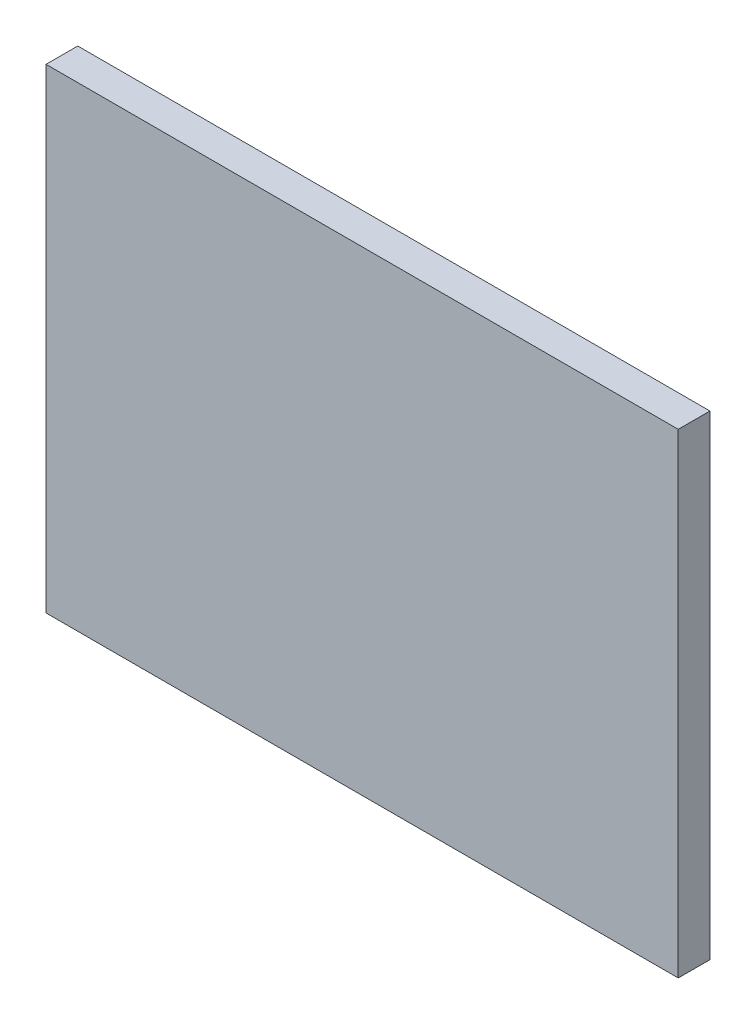
ISO-10303-21;
HEADER;
FILE_DESCRIPTION(('STEP AP214'),'2;1');
FILE_NAME('part.step','',(''),(''),'','','');
FILE_SCHEMA(('AUTOMOTIVE_DESIGN { 1 0 10303 214 1 1 1 1 }'));
ENDSEC;
DATA;
#1=APPLICATION_CONTEXT('core data for automotive mechanical design processes');
#2=APPLICATION_PROTOCOL_DEFINITION('international standard','automotive_design',2000,#1);
#3=PRODUCT_CONTEXT('',#1,'mechanical');
#4=PRODUCT('Part','Part','',(#3));
#5=PRODUCT_RELATED_PRODUCT_CATEGORY('part','',(#4));
#6=PRODUCT_DEFINITION_FORMATION('','',#4);
#7=PRODUCT_DEFINITION_CONTEXT('part definition',#1,'design');
#8=PRODUCT_DEFINITION('design','',#6,#7);
#9=PRODUCT_DEFINITION_SHAPE('','',#8);
#10=(LENGTH_UNIT() NAMED_UNIT(*) SI_UNIT(.MILLI.,.METRE.));
#11=(NAMED_UNIT(*) PLANE_ANGLE_UNIT() SI_UNIT($,.RADIAN.));
#12=(NAMED_UNIT(*) SI_UNIT($,.STERADIAN.) SOLID_ANGLE_UNIT());
#13=UNCERTAINTY_MEASURE_WITH_UNIT(LENGTH_MEASURE(1.E-05),#10,'distance_accuracy_value','');
#14=(GEOMETRIC_REPRESENTATION_CONTEXT(3) GLOBAL_UNCERTAINTY_ASSIGNED_CONTEXT((#13)) GLOBAL_UNIT_ASSIGNED_CONTEXT((#10,
#11,#12)) REPRESENTATION_CONTEXT('',''));
#15=CARTESIAN_POINT('',(0.,0.,0.));
#16=DIRECTION('',(0.,0.,1.));
#17=DIRECTION('',(1.,0.,0.));
#18=AXIS2_PLACEMENT_3D('',#15,#16,#17);
#19=CARTESIAN_POINT('',(0.,0.,5.9));
#20=DIRECTION('',(1.,0.,0.));
#21=DIRECTION('',(0.,0.,-1.));
#22=AXIS2_PLACEMENT_3D('',#19,#20,#21);
#23=PLANE('',#22);
#24=DIRECTION('',(0.,-1.,0.));
#25=VECTOR('',#24,1.);
#26=CARTESIAN_POINT('',(0.,0.,0.));
#27=LINE('',#26,#25);
#28=CARTESIAN_POINT('',(0.,88.43,0.));
#29=VERTEX_POINT('',#28);
#30=CARTESIAN_POINT('',(0.,0.,0.));
#31=VERTEX_POINT('',#30);
#32=EDGE_CURVE('E96',#29,#31,#27,.T.);
#33=ORIENTED_EDGE('',*,*,#32,.T.);
#34=DIRECTION('',(0.,0.,-1.));
#35=VECTOR('',#34,1.);
#36=CARTESIAN_POINT('',(0.,0.,5.9));
#37=LINE('',#36,#35);
#38=CARTESIAN_POINT('',(0.,0.,5.9));
#39=VERTEX_POINT('',#38);
#40=EDGE_CURVE('E11',#39,#31,#37,.T.);
#41=ORIENTED_EDGE('',*,*,#40,.F.);
#42=DIRECTION('',(0.,-1.,0.));
#43=VECTOR('',#42,1.);
#44=CARTESIAN_POINT('',(0.,0.,5.9));
#45=LINE('',#44,#43);
#46=CARTESIAN_POINT('',(0.,88.43,5.9));
#47=VERTEX_POINT('',#46);
#48=EDGE_CURVE('E84',#47,#39,#45,.T.);
#49=ORIENTED_EDGE('',*,*,#48,.F.);
#50=DIRECTION('',(0.,0.,-1.));
#51=VECTOR('',#50,1.);
#52=CARTESIAN_POINT('',(0.,88.43,5.9));
#53=LINE('',#52,#51);
#54=EDGE_CURVE('E92',#47,#29,#53,.T.);
#55=ORIENTED_EDGE('',*,*,#54,.T.);
#56=EDGE_LOOP('',(#33,#41,#49,#55));
#57=FACE_BOUND('',#56,.T.);
#58=ADVANCED_FACE('F33',(#57),#23,.F.);
#59=CARTESIAN_POINT('',(0.,0.,5.9));
#60=DIRECTION('',(0.,1.,0.));
#61=DIRECTION('',(0.,0.,1.));
#62=AXIS2_PLACEMENT_3D('',#59,#60,#61);
#63=PLANE('',#62);
#64=DIRECTION('',(1.,0.,0.));
#65=VECTOR('',#64,1.);
#66=CARTESIAN_POINT('',(0.,0.,0.));
#67=LINE('',#66,#65);
#68=CARTESIAN_POINT('',(117.65,0.,0.));
#69=VERTEX_POINT('',#68);
#70=EDGE_CURVE('E88',#31,#69,#67,.T.);
#71=ORIENTED_EDGE('',*,*,#70,.T.);
#72=DIRECTION('',(0.,0.,-1.));
#73=VECTOR('',#72,1.);
#74=CARTESIAN_POINT('',(117.65,0.,5.9));
#75=LINE('',#74,#73);
#76=CARTESIAN_POINT('',(117.65,0.,5.9));
#77=VERTEX_POINT('',#76);
#78=EDGE_CURVE('E41',#77,#69,#75,.T.);
#79=ORIENTED_EDGE('',*,*,#78,.F.);
#80=DIRECTION('',(1.,0.,0.));
#81=VECTOR('',#80,1.);
#82=CARTESIAN_POINT('',(0.,0.,5.9));
#83=LINE('',#82,#81);
#84=EDGE_CURVE('E79',#39,#77,#83,.T.);
#85=ORIENTED_EDGE('',*,*,#84,.F.);
#86=ORIENTED_EDGE('',*,*,#40,.T.);
#87=EDGE_LOOP('',(#71,#79,#85,#86));
#88=FACE_BOUND('',#87,.T.);
#89=ADVANCED_FACE('F87',(#88),#63,.F.);
#90=CARTESIAN_POINT('',(117.65,0.,5.9));
#91=DIRECTION('',(-1.,0.,0.));
#92=DIRECTION('',(0.,-1.,0.));
#93=AXIS2_PLACEMENT_3D('',#90,#91,#92);
#94=PLANE('',#93);
#95=DIRECTION('',(0.,1.,0.));
#96=VECTOR('',#95,1.);
#97=CARTESIAN_POINT('',(117.65,0.,0.));
#98=LINE('',#97,#96);
#99=CARTESIAN_POINT('',(117.65,88.43,0.));
#100=VERTEX_POINT('',#99);
#101=EDGE_CURVE('E66',#69,#100,#98,.T.);
#102=ORIENTED_EDGE('',*,*,#101,.T.);
#103=DIRECTION('',(0.,0.,-1.));
#104=VECTOR('',#103,1.);
#105=CARTESIAN_POINT('',(117.65,88.43,5.9));
#106=LINE('',#105,#104);
#107=CARTESIAN_POINT('',(117.65,88.43,5.9));
#108=VERTEX_POINT('',#107);
#109=EDGE_CURVE('E89',#108,#100,#106,.T.);
#110=ORIENTED_EDGE('',*,*,#109,.F.);
#111=DIRECTION('',(0.,1.,0.));
#112=VECTOR('',#111,1.);
#113=CARTESIAN_POINT('',(117.65,0.,5.9));
#114=LINE('',#113,#112);
#115=EDGE_CURVE('E82',#77,#108,#114,.T.);
#116=ORIENTED_EDGE('',*,*,#115,.F.);
#117=ORIENTED_EDGE('',*,*,#78,.T.);
#118=EDGE_LOOP('',(#102,#110,#116,#117));
#119=FACE_BOUND('',#118,.T.);
#120=ADVANCED_FACE('F90',(#119),#94,.F.);
#121=CARTESIAN_POINT('',(0.,88.43,5.9));
#122=DIRECTION('',(0.,-1.,0.));
#123=DIRECTION('',(0.,0.,-1.));
#124=AXIS2_PLACEMENT_3D('',#121,#122,#123);
#125=PLANE('',#124);
#126=DIRECTION('',(-1.,0.,0.));
#127=VECTOR('',#126,1.);
#128=CARTESIAN_POINT('',(0.,88.43,0.));
#129=LINE('',#128,#127);
#130=EDGE_CURVE('E72',#100,#29,#129,.T.);
#131=ORIENTED_EDGE('',*,*,#130,.T.);
#132=ORIENTED_EDGE('',*,*,#54,.F.);
#133=DIRECTION('',(-1.,0.,0.));
#134=VECTOR('',#133,1.);
#135=CARTESIAN_POINT('',(0.,88.43,5.9));
#136=LINE('',#135,#134);
#137=EDGE_CURVE('E49',#108,#47,#136,.T.);
#138=ORIENTED_EDGE('',*,*,#137,.F.);
#139=ORIENTED_EDGE('',*,*,#109,.T.);
#140=EDGE_LOOP('',(#131,#132,#138,#139));
#141=FACE_BOUND('',#140,.T.);
#142=ADVANCED_FACE('F103',(#141),#125,.F.);
#143=CARTESIAN_POINT('',(0.,0.,5.9));
#144=DIRECTION('',(0.,0.,-1.));
#145=DIRECTION('',(-1.,0.,0.));
#146=AXIS2_PLACEMENT_3D('',#143,#144,#145);
#147=PLANE('',#146);
#148=ORIENTED_EDGE('',*,*,#48,.T.);
#149=ORIENTED_EDGE('',*,*,#84,.T.);
#150=ORIENTED_EDGE('',*,*,#115,.T.);
#151=ORIENTED_EDGE('',*,*,#137,.T.);
#152=EDGE_LOOP('',(#148,#149,#150,#151));
#153=FACE_BOUND('',#152,.T.);
#154=ADVANCED_FACE('F80',(#153),#147,.F.);
#155=CARTESIAN_POINT('',(0.,0.,0.));
#156=DIRECTION('',(0.,0.,-1.));
#157=DIRECTION('',(-1.,0.,0.));
#158=AXIS2_PLACEMENT_3D('',#155,#156,#157);
#159=PLANE('',#158);
#160=ORIENTED_EDGE('',*,*,#32,.F.);
#161=ORIENTED_EDGE('',*,*,#130,.F.);
#162=ORIENTED_EDGE('',*,*,#101,.F.);
#163=ORIENTED_EDGE('',*,*,#70,.F.);
#164=EDGE_LOOP('',(#160,#161,#162,#163));
#165=FACE_BOUND('',#164,.T.);
#166=ADVANCED_FACE('F106',(#165),#159,.T.);
#167=CLOSED_SHELL('',(#58,#89,#120,#142,#154,#166));
#168=MANIFOLD_SOLID_BREP('B2',#167);
#169=ADVANCED_BREP_SHAPE_REPRESENTATION('',(#18,#168),#14);
#170=SHAPE_DEFINITION_REPRESENTATION(#9,#169);
ENDSEC;
END-ISO-10303-21;
